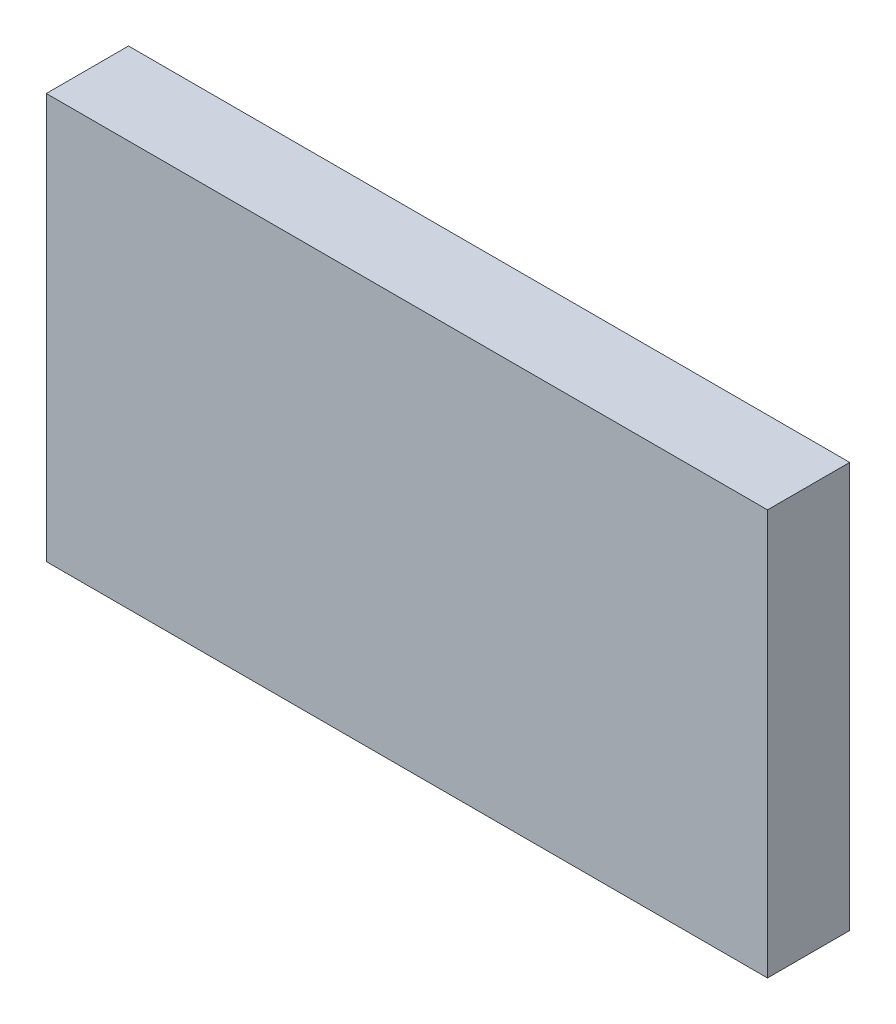
ISO-10303-21;
HEADER;
FILE_DESCRIPTION(('STEP AP214'),'2;1');
FILE_NAME('part.step','',(''),(''),'','','');
FILE_SCHEMA(('AUTOMOTIVE_DESIGN { 1 0 10303 214 1 1 1 1 }'));
ENDSEC;
DATA;
#1=APPLICATION_CONTEXT('core data for automotive mechanical design processes');
#2=APPLICATION_PROTOCOL_DEFINITION('international standard','automotive_design',2000,#1);
#3=PRODUCT_CONTEXT('',#1,'mechanical');
#4=PRODUCT('Part','Part','',(#3));
#5=PRODUCT_RELATED_PRODUCT_CATEGORY('part','',(#4));
#6=PRODUCT_DEFINITION_FORMATION('','',#4);
#7=PRODUCT_DEFINITION_CONTEXT('part definition',#1,'design');
#8=PRODUCT_DEFINITION('design','',#6,#7);
#9=PRODUCT_DEFINITION_SHAPE('','',#8);
#10=(LENGTH_UNIT() NAMED_UNIT(*) SI_UNIT(.MILLI.,.METRE.));
#11=(NAMED_UNIT(*) PLANE_ANGLE_UNIT() SI_UNIT($,.RADIAN.));
#12=(NAMED_UNIT(*) SI_UNIT($,.STERADIAN.) SOLID_ANGLE_UNIT());
#13=UNCERTAINTY_MEASURE_WITH_UNIT(LENGTH_MEASURE(1.E-05),#10,'distance_accuracy_value','');
#14=(GEOMETRIC_REPRESENTATION_CONTEXT(3) GLOBAL_UNCERTAINTY_ASSIGNED_CONTEXT((#13)) GLOBAL_UNIT_ASSIGNED_CONTEXT((#10,
#11,#12)) REPRESENTATION_CONTEXT('',''));
#15=CARTESIAN_POINT('',(0.,0.,0.));
#16=DIRECTION('',(0.,0.,1.));
#17=DIRECTION('',(1.,0.,0.));
#18=AXIS2_PLACEMENT_3D('',#15,#16,#17);
#19=CARTESIAN_POINT('',(0.,0.,10.));
#20=DIRECTION('',(1.,0.,0.));
#21=DIRECTION('',(0.,0.,-1.));
#22=AXIS2_PLACEMENT_3D('',#19,#20,#21);
#23=PLANE('',#22);
#24=DIRECTION('',(0.,-1.,0.));
#25=VECTOR('',#24,1.);
#26=CARTESIAN_POINT('',(0.,0.,0.));
#27=LINE('',#26,#25);
#28=CARTESIAN_POINT('',(0.,49.3121225071225,0.));
#29=VERTEX_POINT('',#28);
#30=CARTESIAN_POINT('',(0.,0.,0.));
#31=VERTEX_POINT('',#30);
#32=EDGE_CURVE('E94',#29,#31,#27,.T.);
#33=ORIENTED_EDGE('',*,*,#32,.T.);
#34=DIRECTION('',(0.,0.,-1.));
#35=VECTOR('',#34,1.);
#36=CARTESIAN_POINT('',(0.,0.,10.));
#37=LINE('',#36,#35);
#38=CARTESIAN_POINT('',(0.,0.,10.));
#39=VERTEX_POINT('',#38);
#40=EDGE_CURVE('E11',#39,#31,#37,.T.);
#41=ORIENTED_EDGE('',*,*,#40,.F.);
#42=DIRECTION('',(0.,-1.,0.));
#43=VECTOR('',#42,1.);
#44=CARTESIAN_POINT('',(0.,0.,10.));
#45=LINE('',#44,#43);
#46=CARTESIAN_POINT('',(0.,49.3121225071225,10.));
#47=VERTEX_POINT('',#46);
#48=EDGE_CURVE('E82',#47,#39,#45,.T.);
#49=ORIENTED_EDGE('',*,*,#48,.F.);
#50=DIRECTION('',(0.,0.,-1.));
#51=VECTOR('',#50,1.);
#52=CARTESIAN_POINT('',(0.,49.3121225071225,10.));
#53=LINE('',#52,#51);
#54=EDGE_CURVE('E90',#47,#29,#53,.T.);
#55=ORIENTED_EDGE('',*,*,#54,.T.);
#56=EDGE_LOOP('',(#33,#41,#49,#55));
#57=FACE_BOUND('',#56,.T.);
#58=ADVANCED_FACE('F31',(#57),#23,.F.);
#59=CARTESIAN_POINT('',(0.,0.,10.));
#60=DIRECTION('',(0.,1.,0.));
#61=DIRECTION('',(0.,0.,1.));
#62=AXIS2_PLACEMENT_3D('',#59,#60,#61);
#63=PLANE('',#62);
#64=DIRECTION('',(1.,0.,0.));
#65=VECTOR('',#64,1.);
#66=CARTESIAN_POINT('',(0.,0.,0.));
#67=LINE('',#66,#65);
#68=CARTESIAN_POINT('',(87.7223361823362,0.,0.));
#69=VERTEX_POINT('',#68);
#70=EDGE_CURVE('E86',#31,#69,#67,.T.);
#71=ORIENTED_EDGE('',*,*,#70,.T.);
#72=DIRECTION('',(0.,0.,-1.));
#73=VECTOR('',#72,1.);
#74=CARTESIAN_POINT('',(87.7223361823362,0.,10.));
#75=LINE('',#74,#73);
#76=CARTESIAN_POINT('',(87.7223361823362,0.,10.));
#77=VERTEX_POINT('',#76);
#78=EDGE_CURVE('E39',#77,#69,#75,.T.);
#79=ORIENTED_EDGE('',*,*,#78,.F.);
#80=DIRECTION('',(1.,0.,0.));
#81=VECTOR('',#80,1.);
#82=CARTESIAN_POINT('',(0.,0.,10.));
#83=LINE('',#82,#81);
#84=EDGE_CURVE('E77',#39,#77,#83,.T.);
#85=ORIENTED_EDGE('',*,*,#84,.F.);
#86=ORIENTED_EDGE('',*,*,#40,.T.);
#87=EDGE_LOOP('',(#71,#79,#85,#86));
#88=FACE_BOUND('',#87,.T.);
#89=ADVANCED_FACE('F85',(#88),#63,.F.);
#90=CARTESIAN_POINT('',(87.7223361823362,0.,10.));
#91=DIRECTION('',(-1.,0.,0.));
#92=DIRECTION('',(0.,0.,1.));
#93=AXIS2_PLACEMENT_3D('',#90,#91,#92);
#94=PLANE('',#93);
#95=DIRECTION('',(0.,1.,0.));
#96=VECTOR('',#95,1.);
#97=CARTESIAN_POINT('',(87.7223361823362,0.,0.));
#98=LINE('',#97,#96);
#99=CARTESIAN_POINT('',(87.7223361823362,49.3121225071225,0.));
#100=VERTEX_POINT('',#99);
#101=EDGE_CURVE('E64',#69,#100,#98,.T.);
#102=ORIENTED_EDGE('',*,*,#101,.T.);
#103=DIRECTION('',(0.,0.,-1.));
#104=VECTOR('',#103,1.);
#105=CARTESIAN_POINT('',(87.7223361823362,49.3121225071225,10.));
#106=LINE('',#105,#104);
#107=CARTESIAN_POINT('',(87.7223361823362,49.3121225071225,10.));
#108=VERTEX_POINT('',#107);
#109=EDGE_CURVE('E87',#108,#100,#106,.T.);
#110=ORIENTED_EDGE('',*,*,#109,.F.);
#111=DIRECTION('',(0.,1.,0.));
#112=VECTOR('',#111,1.);
#113=CARTESIAN_POINT('',(87.7223361823362,0.,10.));
#114=LINE('',#113,#112);
#115=EDGE_CURVE('E80',#77,#108,#114,.T.);
#116=ORIENTED_EDGE('',*,*,#115,.F.);
#117=ORIENTED_EDGE('',*,*,#78,.T.);
#118=EDGE_LOOP('',(#102,#110,#116,#117));
#119=FACE_BOUND('',#118,.T.);
#120=ADVANCED_FACE('F88',(#119),#94,.F.);
#121=CARTESIAN_POINT('',(0.,49.3121225071225,10.));
#122=DIRECTION('',(0.,-1.,0.));
#123=DIRECTION('',(0.,0.,-1.));
#124=AXIS2_PLACEMENT_3D('',#121,#122,#123);
#125=PLANE('',#124);
#126=DIRECTION('',(-1.,0.,0.));
#127=VECTOR('',#126,1.);
#128=CARTESIAN_POINT('',(0.,49.3121225071225,0.));
#129=LINE('',#128,#127);
#130=EDGE_CURVE('E70',#100,#29,#129,.T.);
#131=ORIENTED_EDGE('',*,*,#130,.T.);
#132=ORIENTED_EDGE('',*,*,#54,.F.);
#133=DIRECTION('',(-1.,0.,0.));
#134=VECTOR('',#133,1.);
#135=CARTESIAN_POINT('',(0.,49.3121225071225,10.));
#136=LINE('',#135,#134);
#137=EDGE_CURVE('E47',#108,#47,#136,.T.);
#138=ORIENTED_EDGE('',*,*,#137,.F.);
#139=ORIENTED_EDGE('',*,*,#109,.T.);
#140=EDGE_LOOP('',(#131,#132,#138,#139));
#141=FACE_BOUND('',#140,.T.);
#142=ADVANCED_FACE('F101',(#141),#125,.F.);
#143=CARTESIAN_POINT('',(0.,49.3121225071225,10.));
#144=DIRECTION('',(0.,0.,-1.));
#145=DIRECTION('',(-1.,0.,0.));
#146=AXIS2_PLACEMENT_3D('',#143,#144,#145);
#147=PLANE('',#146);
#148=ORIENTED_EDGE('',*,*,#48,.T.);
#149=ORIENTED_EDGE('',*,*,#84,.T.);
#150=ORIENTED_EDGE('',*,*,#115,.T.);
#151=ORIENTED_EDGE('',*,*,#137,.T.);
#152=EDGE_LOOP('',(#148,#149,#150,#151));
#153=FACE_BOUND('',#152,.T.);
#154=ADVANCED_FACE('F78',(#153),#147,.F.);
#155=CARTESIAN_POINT('',(0.,49.3121225071225,0.));
#156=DIRECTION('',(0.,0.,-1.));
#157=DIRECTION('',(-1.,0.,0.));
#158=AXIS2_PLACEMENT_3D('',#155,#156,#157);
#159=PLANE('',#158);
#160=ORIENTED_EDGE('',*,*,#32,.F.);
#161=ORIENTED_EDGE('',*,*,#130,.F.);
#162=ORIENTED_EDGE('',*,*,#101,.F.);
#163=ORIENTED_EDGE('',*,*,#70,.F.);
#164=EDGE_LOOP('',(#160,#161,#162,#163));
#165=FACE_BOUND('',#164,.T.);
#166=ADVANCED_FACE('F104',(#165),#159,.T.);
#167=CLOSED_SHELL('',(#58,#89,#120,#142,#154,#166));
#168=MANIFOLD_SOLID_BREP('B2',#167);
#169=ADVANCED_BREP_SHAPE_REPRESENTATION('',(#18,#168),#14);
#170=SHAPE_DEFINITION_REPRESENTATION(#9,#169);
ENDSEC;
END-ISO-10303-21;
